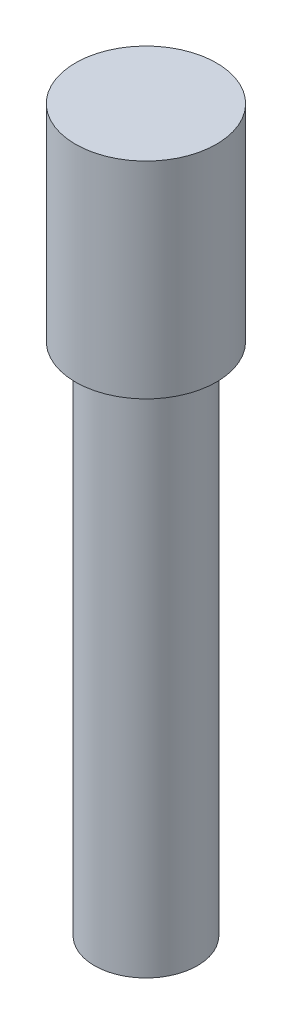
ISO-10303-21;
HEADER;
FILE_DESCRIPTION(('STEP AP214'),'2;1');
FILE_NAME('part.step','',(''),(''),'','','');
FILE_SCHEMA(('AUTOMOTIVE_DESIGN { 1 0 10303 214 1 1 1 1 }'));
ENDSEC;
DATA;
#1=APPLICATION_CONTEXT('core data for automotive mechanical design processes');
#2=APPLICATION_PROTOCOL_DEFINITION('international standard','automotive_design',2000,#1);
#3=PRODUCT_CONTEXT('',#1,'mechanical');
#4=PRODUCT('Part','Part','',(#3));
#5=PRODUCT_RELATED_PRODUCT_CATEGORY('part','',(#4));
#6=PRODUCT_DEFINITION_FORMATION('','',#4);
#7=PRODUCT_DEFINITION_CONTEXT('part definition',#1,'design');
#8=PRODUCT_DEFINITION('design','',#6,#7);
#9=PRODUCT_DEFINITION_SHAPE('','',#8);
#10=(LENGTH_UNIT() NAMED_UNIT(*) SI_UNIT(.MILLI.,.METRE.));
#11=(NAMED_UNIT(*) PLANE_ANGLE_UNIT() SI_UNIT($,.RADIAN.));
#12=(NAMED_UNIT(*) SI_UNIT($,.STERADIAN.) SOLID_ANGLE_UNIT());
#13=UNCERTAINTY_MEASURE_WITH_UNIT(LENGTH_MEASURE(1.E-05),#10,'distance_accuracy_value','');
#14=(GEOMETRIC_REPRESENTATION_CONTEXT(3) GLOBAL_UNCERTAINTY_ASSIGNED_CONTEXT((#13)) GLOBAL_UNIT_ASSIGNED_CONTEXT((#10,
#11,#12)) REPRESENTATION_CONTEXT('',''));
#15=CARTESIAN_POINT('',(0.,0.,0.));
#16=DIRECTION('',(0.,0.,1.));
#17=DIRECTION('',(1.,0.,0.));
#18=AXIS2_PLACEMENT_3D('',#15,#16,#17);
#19=CARTESIAN_POINT('',(0.,5.,0.));
#20=DIRECTION('',(0.,-1.,0.));
#21=DIRECTION('',(0.,0.,-1.));
#22=AXIS2_PLACEMENT_3D('',#19,#20,#21);
#23=CYLINDRICAL_SURFACE('',#22,0.5);
#24=CARTESIAN_POINT('',(0.,5.,0.));
#25=DIRECTION('',(0.,1.,0.));
#26=DIRECTION('',(0.,0.,1.));
#27=AXIS2_PLACEMENT_3D('',#24,#25,#26);
#28=CIRCLE('',#27,0.5);
#29=CARTESIAN_POINT('',(0.,5.,0.5));
#30=VERTEX_POINT('',#29);
#31=EDGE_CURVE('E10',#30,#30,#28,.T.);
#32=ORIENTED_EDGE('',*,*,#31,.F.);
#33=EDGE_LOOP('',(#32));
#34=FACE_BOUND('',#33,.T.);
#35=CARTESIAN_POINT('',(0.,0.,0.));
#36=DIRECTION('',(0.,1.,0.));
#37=DIRECTION('',(0.,0.,1.));
#38=AXIS2_PLACEMENT_3D('',#35,#36,#37);
#39=CIRCLE('',#38,0.5);
#40=CARTESIAN_POINT('',(0.,0.,0.5));
#41=VERTEX_POINT('',#40);
#42=EDGE_CURVE('E36',#41,#41,#39,.T.);
#43=ORIENTED_EDGE('',*,*,#42,.T.);
#44=EDGE_LOOP('',(#43));
#45=FACE_BOUND('',#44,.T.);
#46=ADVANCED_FACE('F33',(#34,#45),#23,.T.);
#47=CARTESIAN_POINT('',(0.,0.,0.));
#48=DIRECTION('',(0.,1.,0.));
#49=DIRECTION('',(0.,0.,1.));
#50=AXIS2_PLACEMENT_3D('',#47,#48,#49);
#51=PLANE('',#50);
#52=ORIENTED_EDGE('',*,*,#42,.F.);
#53=EDGE_LOOP('',(#52));
#54=FACE_BOUND('',#53,.T.);
#55=ADVANCED_FACE('F56',(#54),#51,.F.);
#56=CARTESIAN_POINT('',(0.,7.,0.));
#57=DIRECTION('',(0.,-1.,0.));
#58=DIRECTION('',(0.,0.,-1.));
#59=AXIS2_PLACEMENT_3D('',#56,#57,#58);
#60=CYLINDRICAL_SURFACE('',#59,0.684508395589026);
#61=CARTESIAN_POINT('',(0.,7.,0.));
#62=DIRECTION('',(0.,1.,0.));
#63=DIRECTION('',(0.,0.,1.));
#64=AXIS2_PLACEMENT_3D('',#61,#62,#63);
#65=CIRCLE('',#64,0.684508395589026);
#66=CARTESIAN_POINT('',(0.,7.,0.684508395589026));
#67=VERTEX_POINT('',#66);
#68=EDGE_CURVE('E43',#67,#67,#65,.T.);
#69=ORIENTED_EDGE('',*,*,#68,.F.);
#70=EDGE_LOOP('',(#69));
#71=FACE_BOUND('',#70,.T.);
#72=CARTESIAN_POINT('',(0.,5.,0.));
#73=DIRECTION('',(0.,1.,0.));
#74=DIRECTION('',(0.,0.,1.));
#75=AXIS2_PLACEMENT_3D('',#72,#73,#74);
#76=CIRCLE('',#75,0.684508395589026);
#77=CARTESIAN_POINT('',(0.,5.,0.684508395589026));
#78=VERTEX_POINT('',#77);
#79=EDGE_CURVE('E45',#78,#78,#76,.T.);
#80=ORIENTED_EDGE('',*,*,#79,.T.);
#81=EDGE_LOOP('',(#80));
#82=FACE_BOUND('',#81,.T.);
#83=ADVANCED_FACE('F53',(#71,#82),#60,.T.);
#84=CARTESIAN_POINT('',(0.,7.,0.));
#85=DIRECTION('',(0.,1.,0.));
#86=DIRECTION('',(0.,0.,1.));
#87=AXIS2_PLACEMENT_3D('',#84,#85,#86);
#88=PLANE('',#87);
#89=ORIENTED_EDGE('',*,*,#68,.T.);
#90=EDGE_LOOP('',(#89));
#91=FACE_BOUND('',#90,.T.);
#92=ADVANCED_FACE('F51',(#91),#88,.T.);
#93=CARTESIAN_POINT('',(0.,5.,0.));
#94=DIRECTION('',(0.,1.,0.));
#95=DIRECTION('',(0.,0.,1.));
#96=AXIS2_PLACEMENT_3D('',#93,#94,#95);
#97=PLANE('',#96);
#98=ORIENTED_EDGE('',*,*,#31,.T.);
#99=EDGE_LOOP('',(#98));
#100=FACE_BOUND('',#99,.T.);
#101=ORIENTED_EDGE('',*,*,#79,.F.);
#102=EDGE_LOOP('',(#101));
#103=FACE_BOUND('',#102,.T.);
#104=ADVANCED_FACE('F60',(#100,#103),#97,.F.);
#105=CLOSED_SHELL('',(#46,#55,#83,#92,#104));
#106=MANIFOLD_SOLID_BREP('B2',#105);
#107=ADVANCED_BREP_SHAPE_REPRESENTATION('',(#18,#106),#14);
#108=SHAPE_DEFINITION_REPRESENTATION(#9,#107);
ENDSEC;
END-ISO-10303-21;
